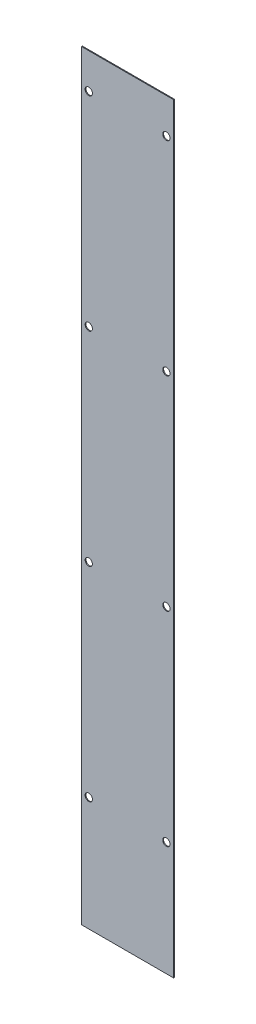
ISO-10303-21;
HEADER;
FILE_DESCRIPTION(('STEP AP214'),'2;1');
FILE_NAME('part.step','',(''),(''),'','','');
FILE_SCHEMA(('AUTOMOTIVE_DESIGN { 1 0 10303 214 1 1 1 1 }'));
ENDSEC;
DATA;
#1=APPLICATION_CONTEXT('core data for automotive mechanical design processes');
#2=APPLICATION_PROTOCOL_DEFINITION('international standard','automotive_design',2000,#1);
#3=PRODUCT_CONTEXT('',#1,'mechanical');
#4=PRODUCT('Part','Part','',(#3));
#5=PRODUCT_RELATED_PRODUCT_CATEGORY('part','',(#4));
#6=PRODUCT_DEFINITION_FORMATION('','',#4);
#7=PRODUCT_DEFINITION_CONTEXT('part definition',#1,'design');
#8=PRODUCT_DEFINITION('design','',#6,#7);
#9=PRODUCT_DEFINITION_SHAPE('','',#8);
#10=(LENGTH_UNIT() NAMED_UNIT(*) SI_UNIT(.MILLI.,.METRE.));
#11=(NAMED_UNIT(*) PLANE_ANGLE_UNIT() SI_UNIT($,.RADIAN.));
#12=(NAMED_UNIT(*) SI_UNIT($,.STERADIAN.) SOLID_ANGLE_UNIT());
#13=UNCERTAINTY_MEASURE_WITH_UNIT(LENGTH_MEASURE(1.E-05),#10,'distance_accuracy_value','');
#14=(GEOMETRIC_REPRESENTATION_CONTEXT(3) GLOBAL_UNCERTAINTY_ASSIGNED_CONTEXT((#13)) GLOBAL_UNIT_ASSIGNED_CONTEXT((#10,
#11,#12)) REPRESENTATION_CONTEXT('',''));
#15=CARTESIAN_POINT('',(0.,0.,0.));
#16=DIRECTION('',(0.,0.,1.));
#17=DIRECTION('',(1.,0.,0.));
#18=AXIS2_PLACEMENT_3D('',#15,#16,#17);
#19=CARTESIAN_POINT('',(0.,0.,-0.7));
#20=DIRECTION('',(-1.,0.,0.));
#21=DIRECTION('',(0.,0.,1.));
#22=AXIS2_PLACEMENT_3D('',#19,#20,#21);
#23=PLANE('',#22);
#24=DIRECTION('',(0.,-1.,0.));
#25=VECTOR('',#24,1.);
#26=CARTESIAN_POINT('',(0.,0.,0.));
#27=LINE('',#26,#25);
#28=CARTESIAN_POINT('',(0.,627.,0.));
#29=VERTEX_POINT('',#28);
#30=CARTESIAN_POINT('',(0.,0.,0.));
#31=VERTEX_POINT('',#30);
#32=EDGE_CURVE('E103',#29,#31,#27,.T.);
#33=ORIENTED_EDGE('',*,*,#32,.F.);
#34=DIRECTION('',(0.,0.,1.));
#35=VECTOR('',#34,1.);
#36=CARTESIAN_POINT('',(0.,627.,-0.7));
#37=LINE('',#36,#35);
#38=CARTESIAN_POINT('',(0.,627.,-0.7));
#39=VERTEX_POINT('',#38);
#40=EDGE_CURVE('E11',#39,#29,#37,.T.);
#41=ORIENTED_EDGE('',*,*,#40,.F.);
#42=DIRECTION('',(0.,-1.,0.));
#43=VECTOR('',#42,1.);
#44=CARTESIAN_POINT('',(0.,0.,-0.7));
#45=LINE('',#44,#43);
#46=CARTESIAN_POINT('',(0.,0.,-0.7));
#47=VERTEX_POINT('',#46);
#48=EDGE_CURVE('E96',#39,#47,#45,.T.);
#49=ORIENTED_EDGE('',*,*,#48,.T.);
#50=DIRECTION('',(0.,0.,1.));
#51=VECTOR('',#50,1.);
#52=CARTESIAN_POINT('',(0.,0.,-0.7));
#53=LINE('',#52,#51);
#54=EDGE_CURVE('E41',#47,#31,#53,.T.);
#55=ORIENTED_EDGE('',*,*,#54,.T.);
#56=EDGE_LOOP('',(#33,#41,#49,#55));
#57=FACE_BOUND('',#56,.T.);
#58=ADVANCED_FACE('F38',(#57),#23,.T.);
#59=CARTESIAN_POINT('',(0.,627.,-0.7));
#60=DIRECTION('',(0.,1.,0.));
#61=DIRECTION('',(0.,0.,1.));
#62=AXIS2_PLACEMENT_3D('',#59,#60,#61);
#63=PLANE('',#62);
#64=DIRECTION('',(-1.,0.,0.));
#65=VECTOR('',#64,1.);
#66=CARTESIAN_POINT('',(0.,627.,0.));
#67=LINE('',#66,#65);
#68=CARTESIAN_POINT('',(76.,627.,0.));
#69=VERTEX_POINT('',#68);
#70=EDGE_CURVE('E98',#69,#29,#67,.T.);
#71=ORIENTED_EDGE('',*,*,#70,.F.);
#72=DIRECTION('',(0.,0.,1.));
#73=VECTOR('',#72,1.);
#74=CARTESIAN_POINT('',(76.,627.,-0.7));
#75=LINE('',#74,#73);
#76=CARTESIAN_POINT('',(76.,627.,-0.7));
#77=VERTEX_POINT('',#76);
#78=EDGE_CURVE('E47',#77,#69,#75,.T.);
#79=ORIENTED_EDGE('',*,*,#78,.F.);
#80=DIRECTION('',(-1.,0.,0.));
#81=VECTOR('',#80,1.);
#82=CARTESIAN_POINT('',(0.,627.,-0.7));
#83=LINE('',#82,#81);
#84=EDGE_CURVE('E93',#77,#39,#83,.T.);
#85=ORIENTED_EDGE('',*,*,#84,.T.);
#86=ORIENTED_EDGE('',*,*,#40,.T.);
#87=EDGE_LOOP('',(#71,#79,#85,#86));
#88=FACE_BOUND('',#87,.T.);
#89=ADVANCED_FACE('F114',(#88),#63,.T.);
#90=CARTESIAN_POINT('',(76.,0.,-0.7));
#91=DIRECTION('',(1.,0.,0.));
#92=DIRECTION('',(0.,0.,-1.));
#93=AXIS2_PLACEMENT_3D('',#90,#91,#92);
#94=PLANE('',#93);
#95=DIRECTION('',(0.,1.,0.));
#96=VECTOR('',#95,1.);
#97=CARTESIAN_POINT('',(76.,0.,0.));
#98=LINE('',#97,#96);
#99=CARTESIAN_POINT('',(76.,0.,0.));
#100=VERTEX_POINT('',#99);
#101=EDGE_CURVE('E88',#100,#69,#98,.T.);
#102=ORIENTED_EDGE('',*,*,#101,.F.);
#103=DIRECTION('',(0.,0.,1.));
#104=VECTOR('',#103,1.);
#105=CARTESIAN_POINT('',(76.,0.,-0.7));
#106=LINE('',#105,#104);
#107=CARTESIAN_POINT('',(76.,0.,-0.7));
#108=VERTEX_POINT('',#107);
#109=EDGE_CURVE('E83',#108,#100,#106,.T.);
#110=ORIENTED_EDGE('',*,*,#109,.F.);
#111=DIRECTION('',(0.,1.,0.));
#112=VECTOR('',#111,1.);
#113=CARTESIAN_POINT('',(76.,0.,-0.7));
#114=LINE('',#113,#112);
#115=EDGE_CURVE('E86',#108,#77,#114,.T.);
#116=ORIENTED_EDGE('',*,*,#115,.T.);
#117=ORIENTED_EDGE('',*,*,#78,.T.);
#118=EDGE_LOOP('',(#102,#110,#116,#117));
#119=FACE_BOUND('',#118,.T.);
#120=ADVANCED_FACE('F85',(#119),#94,.T.);
#121=CARTESIAN_POINT('',(0.,0.,-0.7));
#122=DIRECTION('',(0.,-1.,0.));
#123=DIRECTION('',(0.,0.,-1.));
#124=AXIS2_PLACEMENT_3D('',#121,#122,#123);
#125=PLANE('',#124);
#126=DIRECTION('',(1.,0.,0.));
#127=VECTOR('',#126,1.);
#128=CARTESIAN_POINT('',(0.,0.,0.));
#129=LINE('',#128,#127);
#130=EDGE_CURVE('E106',#31,#100,#129,.T.);
#131=ORIENTED_EDGE('',*,*,#130,.F.);
#132=ORIENTED_EDGE('',*,*,#54,.F.);
#133=DIRECTION('',(1.,0.,0.));
#134=VECTOR('',#133,1.);
#135=CARTESIAN_POINT('',(0.,0.,-0.7));
#136=LINE('',#135,#134);
#137=EDGE_CURVE('E92',#47,#108,#136,.T.);
#138=ORIENTED_EDGE('',*,*,#137,.T.);
#139=ORIENTED_EDGE('',*,*,#109,.T.);
#140=EDGE_LOOP('',(#131,#132,#138,#139));
#141=FACE_BOUND('',#140,.T.);
#142=ADVANCED_FACE('F95',(#141),#125,.T.);
#143=CARTESIAN_POINT('',(0.,0.,-0.7));
#144=DIRECTION('',(0.,0.,-1.));
#145=DIRECTION('',(-1.,0.,0.));
#146=AXIS2_PLACEMENT_3D('',#143,#144,#145);
#147=PLANE('',#146);
#148=CARTESIAN_POINT('',(6.00000000000002,598.,-0.699999999999999));
#149=DIRECTION('',(0.,0.,-1.));
#150=DIRECTION('',(-1.,0.,0.));
#151=AXIS2_PLACEMENT_3D('',#148,#149,#150);
#152=CIRCLE('',#151,3.00000000000001);
#153=CARTESIAN_POINT('',(3.00000000000001,598.,-0.699999999999999));
#154=VERTEX_POINT('',#153);
#155=EDGE_CURVE('E107',#154,#154,#152,.T.);
#156=ORIENTED_EDGE('',*,*,#155,.F.);
#157=EDGE_LOOP('',(#156));
#158=FACE_BOUND('',#157,.T.);
#159=CARTESIAN_POINT('',(5.9999999999983,430.,-0.699999999999999));
#160=DIRECTION('',(0.,0.,-1.));
#161=DIRECTION('',(-1.,0.,0.));
#162=AXIS2_PLACEMENT_3D('',#159,#160,#161);
#163=CIRCLE('',#162,3.00000000000001);
#164=CARTESIAN_POINT('',(2.99999999999829,430.,-0.699999999999999));
#165=VERTEX_POINT('',#164);
#166=EDGE_CURVE('E216',#165,#165,#163,.T.);
#167=ORIENTED_EDGE('',*,*,#166,.F.);
#168=EDGE_LOOP('',(#167));
#169=FACE_BOUND('',#168,.T.);
#170=CARTESIAN_POINT('',(5.99999999999658,262.,-0.699999999999999));
#171=DIRECTION('',(0.,0.,-1.));
#172=DIRECTION('',(-1.,0.,0.));
#173=AXIS2_PLACEMENT_3D('',#170,#171,#172);
#174=CIRCLE('',#173,3.00000000000001);
#175=CARTESIAN_POINT('',(2.99999999999657,262.,-0.699999999999999));
#176=VERTEX_POINT('',#175);
#177=EDGE_CURVE('E213',#176,#176,#174,.T.);
#178=ORIENTED_EDGE('',*,*,#177,.F.);
#179=EDGE_LOOP('',(#178));
#180=FACE_BOUND('',#179,.T.);
#181=CARTESIAN_POINT('',(5.99999999999487,94.,-0.699999999999999));
#182=DIRECTION('',(0.,0.,-1.));
#183=DIRECTION('',(-1.,0.,0.));
#184=AXIS2_PLACEMENT_3D('',#181,#182,#183);
#185=CIRCLE('',#184,3.00000000000001);
#186=CARTESIAN_POINT('',(2.99999999999486,94.,-0.699999999999999));
#187=VERTEX_POINT('',#186);
#188=EDGE_CURVE('E210',#187,#187,#185,.T.);
#189=ORIENTED_EDGE('',*,*,#188,.F.);
#190=EDGE_LOOP('',(#189));
#191=FACE_BOUND('',#190,.T.);
#192=CARTESIAN_POINT('',(70.0000000000053,94.,-0.699999999999999));
#193=DIRECTION('',(0.,0.,-1.));
#194=DIRECTION('',(-1.,0.,0.));
#195=AXIS2_PLACEMENT_3D('',#192,#193,#194);
#196=CIRCLE('',#195,3.00000000000001);
#197=CARTESIAN_POINT('',(67.0000000000053,94.,-0.699999999999999));
#198=VERTEX_POINT('',#197);
#199=EDGE_CURVE('E207',#198,#198,#196,.T.);
#200=ORIENTED_EDGE('',*,*,#199,.F.);
#201=EDGE_LOOP('',(#200));
#202=FACE_BOUND('',#201,.T.);
#203=CARTESIAN_POINT('',(70.0000000000035,262.,-0.699999999999999));
#204=DIRECTION('',(0.,0.,-1.));
#205=DIRECTION('',(-1.,0.,0.));
#206=AXIS2_PLACEMENT_3D('',#203,#204,#205);
#207=CIRCLE('',#206,3.00000000000001);
#208=CARTESIAN_POINT('',(67.0000000000035,262.,-0.699999999999999));
#209=VERTEX_POINT('',#208);
#210=EDGE_CURVE('E204',#209,#209,#207,.T.);
#211=ORIENTED_EDGE('',*,*,#210,.F.);
#212=EDGE_LOOP('',(#211));
#213=FACE_BOUND('',#212,.T.);
#214=CARTESIAN_POINT('',(70.0000000000018,430.,-0.699999999999999));
#215=DIRECTION('',(0.,0.,-1.));
#216=DIRECTION('',(-1.,0.,0.));
#217=AXIS2_PLACEMENT_3D('',#214,#215,#216);
#218=CIRCLE('',#217,3.00000000000001);
#219=CARTESIAN_POINT('',(67.0000000000017,430.,-0.699999999999999));
#220=VERTEX_POINT('',#219);
#221=EDGE_CURVE('E172',#220,#220,#218,.T.);
#222=ORIENTED_EDGE('',*,*,#221,.F.);
#223=EDGE_LOOP('',(#222));
#224=FACE_BOUND('',#223,.T.);
#225=CARTESIAN_POINT('',(70.,598.,-0.699999999999999));
#226=DIRECTION('',(0.,0.,-1.));
#227=DIRECTION('',(-1.,0.,0.));
#228=AXIS2_PLACEMENT_3D('',#225,#226,#227);
#229=CIRCLE('',#228,3.00000000000001);
#230=CARTESIAN_POINT('',(67.,598.,-0.699999999999999));
#231=VERTEX_POINT('',#230);
#232=EDGE_CURVE('E181',#231,#231,#229,.T.);
#233=ORIENTED_EDGE('',*,*,#232,.F.);
#234=EDGE_LOOP('',(#233));
#235=FACE_BOUND('',#234,.T.);
#236=ORIENTED_EDGE('',*,*,#48,.F.);
#237=ORIENTED_EDGE('',*,*,#84,.F.);
#238=ORIENTED_EDGE('',*,*,#115,.F.);
#239=ORIENTED_EDGE('',*,*,#137,.F.);
#240=EDGE_LOOP('',(#236,#237,#238,#239));
#241=FACE_BOUND('',#240,.T.);
#242=ADVANCED_FACE('F91',(#158,#169,#180,#191,#202,#213,#224,#235,#241),#147,.T.);
#243=CARTESIAN_POINT('',(0.,0.,0.));
#244=DIRECTION('',(0.,0.,-1.));
#245=DIRECTION('',(-1.,0.,0.));
#246=AXIS2_PLACEMENT_3D('',#243,#244,#245);
#247=PLANE('',#246);
#248=CARTESIAN_POINT('',(6.00000000000002,598.,0.));
#249=DIRECTION('',(0.,0.,1.));
#250=DIRECTION('',(-1.,0.,0.));
#251=AXIS2_PLACEMENT_3D('',#248,#249,#250);
#252=CIRCLE('',#251,3.00000000000001);
#253=CARTESIAN_POINT('',(3.00000000000001,598.,0.));
#254=VERTEX_POINT('',#253);
#255=EDGE_CURVE('E198',#254,#254,#252,.T.);
#256=ORIENTED_EDGE('',*,*,#255,.F.);
#257=EDGE_LOOP('',(#256));
#258=FACE_BOUND('',#257,.T.);
#259=CARTESIAN_POINT('',(5.9999999999983,430.,0.));
#260=DIRECTION('',(0.,0.,1.));
#261=DIRECTION('',(-1.,0.,0.));
#262=AXIS2_PLACEMENT_3D('',#259,#260,#261);
#263=CIRCLE('',#262,3.00000000000001);
#264=CARTESIAN_POINT('',(2.99999999999829,430.,0.));
#265=VERTEX_POINT('',#264);
#266=EDGE_CURVE('E195',#265,#265,#263,.T.);
#267=ORIENTED_EDGE('',*,*,#266,.F.);
#268=EDGE_LOOP('',(#267));
#269=FACE_BOUND('',#268,.T.);
#270=CARTESIAN_POINT('',(5.99999999999658,262.,0.));
#271=DIRECTION('',(0.,0.,1.));
#272=DIRECTION('',(-1.,0.,0.));
#273=AXIS2_PLACEMENT_3D('',#270,#271,#272);
#274=CIRCLE('',#273,3.00000000000001);
#275=CARTESIAN_POINT('',(2.99999999999657,262.,0.));
#276=VERTEX_POINT('',#275);
#277=EDGE_CURVE('E192',#276,#276,#274,.T.);
#278=ORIENTED_EDGE('',*,*,#277,.F.);
#279=EDGE_LOOP('',(#278));
#280=FACE_BOUND('',#279,.T.);
#281=CARTESIAN_POINT('',(5.99999999999487,94.,0.));
#282=DIRECTION('',(0.,0.,1.));
#283=DIRECTION('',(-1.,0.,0.));
#284=AXIS2_PLACEMENT_3D('',#281,#282,#283);
#285=CIRCLE('',#284,3.00000000000001);
#286=CARTESIAN_POINT('',(2.99999999999486,94.,0.));
#287=VERTEX_POINT('',#286);
#288=EDGE_CURVE('E189',#287,#287,#285,.T.);
#289=ORIENTED_EDGE('',*,*,#288,.F.);
#290=EDGE_LOOP('',(#289));
#291=FACE_BOUND('',#290,.T.);
#292=CARTESIAN_POINT('',(70.0000000000053,94.,0.));
#293=DIRECTION('',(0.,0.,1.));
#294=DIRECTION('',(1.,0.,0.));
#295=AXIS2_PLACEMENT_3D('',#292,#293,#294);
#296=CIRCLE('',#295,3.00000000000001);
#297=CARTESIAN_POINT('',(73.0000000000053,94.,0.));
#298=VERTEX_POINT('',#297);
#299=EDGE_CURVE('E184',#298,#298,#296,.T.);
#300=ORIENTED_EDGE('',*,*,#299,.F.);
#301=EDGE_LOOP('',(#300));
#302=FACE_BOUND('',#301,.T.);
#303=CARTESIAN_POINT('',(70.0000000000035,262.,0.));
#304=DIRECTION('',(0.,0.,1.));
#305=DIRECTION('',(1.,0.,0.));
#306=AXIS2_PLACEMENT_3D('',#303,#304,#305);
#307=CIRCLE('',#306,3.00000000000001);
#308=CARTESIAN_POINT('',(73.0000000000035,262.,0.));
#309=VERTEX_POINT('',#308);
#310=EDGE_CURVE('E178',#309,#309,#307,.T.);
#311=ORIENTED_EDGE('',*,*,#310,.F.);
#312=EDGE_LOOP('',(#311));
#313=FACE_BOUND('',#312,.T.);
#314=CARTESIAN_POINT('',(70.0000000000018,430.,0.));
#315=DIRECTION('',(0.,0.,1.));
#316=DIRECTION('',(1.,0.,0.));
#317=AXIS2_PLACEMENT_3D('',#314,#315,#316);
#318=CIRCLE('',#317,3.00000000000001);
#319=CARTESIAN_POINT('',(73.0000000000018,430.,0.));
#320=VERTEX_POINT('',#319);
#321=EDGE_CURVE('E175',#320,#320,#318,.T.);
#322=ORIENTED_EDGE('',*,*,#321,.F.);
#323=EDGE_LOOP('',(#322));
#324=FACE_BOUND('',#323,.T.);
#325=CARTESIAN_POINT('',(70.,598.,0.));
#326=DIRECTION('',(0.,0.,1.));
#327=DIRECTION('',(1.,0.,0.));
#328=AXIS2_PLACEMENT_3D('',#325,#326,#327);
#329=CIRCLE('',#328,3.00000000000001);
#330=CARTESIAN_POINT('',(73.,598.,0.));
#331=VERTEX_POINT('',#330);
#332=EDGE_CURVE('E177',#331,#331,#329,.T.);
#333=ORIENTED_EDGE('',*,*,#332,.F.);
#334=EDGE_LOOP('',(#333));
#335=FACE_BOUND('',#334,.T.);
#336=ORIENTED_EDGE('',*,*,#32,.T.);
#337=ORIENTED_EDGE('',*,*,#130,.T.);
#338=ORIENTED_EDGE('',*,*,#101,.T.);
#339=ORIENTED_EDGE('',*,*,#70,.T.);
#340=EDGE_LOOP('',(#336,#337,#338,#339));
#341=FACE_BOUND('',#340,.T.);
#342=ADVANCED_FACE('F113',(#258,#269,#280,#291,#302,#313,#324,#335,#341),#247,.F.);
#343=CARTESIAN_POINT('',(70.,598.,-10.));
#344=DIRECTION('',(0.,0.,1.));
#345=DIRECTION('',(1.,0.,0.));
#346=AXIS2_PLACEMENT_3D('',#343,#344,#345);
#347=CYLINDRICAL_SURFACE('',#346,3.00000000000001);
#348=ORIENTED_EDGE('',*,*,#232,.T.);
#349=EDGE_LOOP('',(#348));
#350=FACE_BOUND('',#349,.T.);
#351=ORIENTED_EDGE('',*,*,#332,.T.);
#352=EDGE_LOOP('',(#351));
#353=FACE_BOUND('',#352,.T.);
#354=ADVANCED_FACE('F132',(#350,#353),#347,.F.);
#355=CARTESIAN_POINT('',(70.0000000000018,430.,-10.));
#356=DIRECTION('',(0.,0.,1.));
#357=DIRECTION('',(1.,0.,0.));
#358=AXIS2_PLACEMENT_3D('',#355,#356,#357);
#359=CYLINDRICAL_SURFACE('',#358,3.00000000000001);
#360=ORIENTED_EDGE('',*,*,#221,.T.);
#361=EDGE_LOOP('',(#360));
#362=FACE_BOUND('',#361,.T.);
#363=ORIENTED_EDGE('',*,*,#321,.T.);
#364=EDGE_LOOP('',(#363));
#365=FACE_BOUND('',#364,.T.);
#366=ADVANCED_FACE('F139',(#362,#365),#359,.F.);
#367=CARTESIAN_POINT('',(70.0000000000035,262.,-10.));
#368=DIRECTION('',(0.,0.,1.));
#369=DIRECTION('',(1.,0.,0.));
#370=AXIS2_PLACEMENT_3D('',#367,#368,#369);
#371=CYLINDRICAL_SURFACE('',#370,3.00000000000001);
#372=ORIENTED_EDGE('',*,*,#210,.T.);
#373=EDGE_LOOP('',(#372));
#374=FACE_BOUND('',#373,.T.);
#375=ORIENTED_EDGE('',*,*,#310,.T.);
#376=EDGE_LOOP('',(#375));
#377=FACE_BOUND('',#376,.T.);
#378=ADVANCED_FACE('F160',(#374,#377),#371,.F.);
#379=CARTESIAN_POINT('',(70.0000000000053,94.,-10.));
#380=DIRECTION('',(0.,0.,1.));
#381=DIRECTION('',(1.,0.,0.));
#382=AXIS2_PLACEMENT_3D('',#379,#380,#381);
#383=CYLINDRICAL_SURFACE('',#382,3.00000000000001);
#384=ORIENTED_EDGE('',*,*,#199,.T.);
#385=EDGE_LOOP('',(#384));
#386=FACE_BOUND('',#385,.T.);
#387=ORIENTED_EDGE('',*,*,#299,.T.);
#388=EDGE_LOOP('',(#387));
#389=FACE_BOUND('',#388,.T.);
#390=ADVANCED_FACE('F156',(#386,#389),#383,.F.);
#391=CARTESIAN_POINT('',(5.99999999999487,94.,-10.));
#392=DIRECTION('',(0.,0.,1.));
#393=DIRECTION('',(1.,0.,0.));
#394=AXIS2_PLACEMENT_3D('',#391,#392,#393);
#395=CYLINDRICAL_SURFACE('',#394,3.00000000000001);
#396=ORIENTED_EDGE('',*,*,#188,.T.);
#397=EDGE_LOOP('',(#396));
#398=FACE_BOUND('',#397,.T.);
#399=ORIENTED_EDGE('',*,*,#288,.T.);
#400=EDGE_LOOP('',(#399));
#401=FACE_BOUND('',#400,.T.);
#402=ADVANCED_FACE('F152',(#398,#401),#395,.F.);
#403=CARTESIAN_POINT('',(5.99999999999658,262.,-10.));
#404=DIRECTION('',(0.,0.,1.));
#405=DIRECTION('',(1.,0.,0.));
#406=AXIS2_PLACEMENT_3D('',#403,#404,#405);
#407=CYLINDRICAL_SURFACE('',#406,3.00000000000001);
#408=ORIENTED_EDGE('',*,*,#177,.T.);
#409=EDGE_LOOP('',(#408));
#410=FACE_BOUND('',#409,.T.);
#411=ORIENTED_EDGE('',*,*,#277,.T.);
#412=EDGE_LOOP('',(#411));
#413=FACE_BOUND('',#412,.T.);
#414=ADVANCED_FACE('F148',(#410,#413),#407,.F.);
#415=CARTESIAN_POINT('',(5.9999999999983,430.,-10.));
#416=DIRECTION('',(0.,0.,1.));
#417=DIRECTION('',(1.,0.,0.));
#418=AXIS2_PLACEMENT_3D('',#415,#416,#417);
#419=CYLINDRICAL_SURFACE('',#418,3.00000000000001);
#420=ORIENTED_EDGE('',*,*,#166,.T.);
#421=EDGE_LOOP('',(#420));
#422=FACE_BOUND('',#421,.T.);
#423=ORIENTED_EDGE('',*,*,#266,.T.);
#424=EDGE_LOOP('',(#423));
#425=FACE_BOUND('',#424,.T.);
#426=ADVANCED_FACE('F144',(#422,#425),#419,.F.);
#427=CARTESIAN_POINT('',(6.00000000000002,598.,-10.));
#428=DIRECTION('',(0.,0.,1.));
#429=DIRECTION('',(1.,0.,0.));
#430=AXIS2_PLACEMENT_3D('',#427,#428,#429);
#431=CYLINDRICAL_SURFACE('',#430,3.00000000000001);
#432=ORIENTED_EDGE('',*,*,#155,.T.);
#433=EDGE_LOOP('',(#432));
#434=FACE_BOUND('',#433,.T.);
#435=ORIENTED_EDGE('',*,*,#255,.T.);
#436=EDGE_LOOP('',(#435));
#437=FACE_BOUND('',#436,.T.);
#438=ADVANCED_FACE('F141',(#434,#437),#431,.F.);
#439=CLOSED_SHELL('',(#58,#89,#120,#142,#242,#342,#354,#366,#378,#390,#402,#414,#426,#438));
#440=MANIFOLD_SOLID_BREP('B2',#439);
#441=ADVANCED_BREP_SHAPE_REPRESENTATION('',(#18,#440),#14);
#442=SHAPE_DEFINITION_REPRESENTATION(#9,#441);
ENDSEC;
END-ISO-10303-21;
